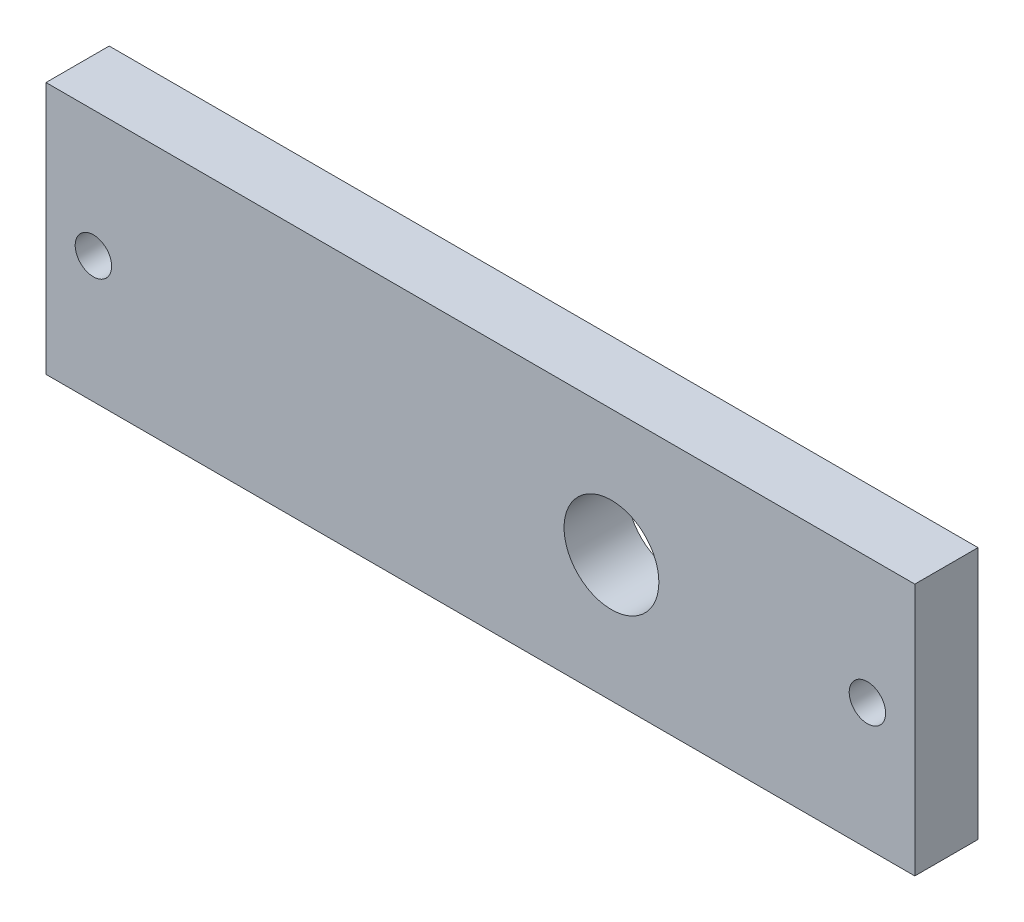
ISO-10303-21;
HEADER;
FILE_DESCRIPTION(('STEP AP214'),'2;1');
FILE_NAME('part.step','',(''),(''),'','','');
FILE_SCHEMA(('AUTOMOTIVE_DESIGN { 1 0 10303 214 1 1 1 1 }'));
ENDSEC;
DATA;
#1=APPLICATION_CONTEXT('core data for automotive mechanical design processes');
#2=APPLICATION_PROTOCOL_DEFINITION('international standard','automotive_design',2000,#1);
#3=PRODUCT_CONTEXT('',#1,'mechanical');
#4=PRODUCT('Part','Part','',(#3));
#5=PRODUCT_RELATED_PRODUCT_CATEGORY('part','',(#4));
#6=PRODUCT_DEFINITION_FORMATION('','',#4);
#7=PRODUCT_DEFINITION_CONTEXT('part definition',#1,'design');
#8=PRODUCT_DEFINITION('design','',#6,#7);
#9=PRODUCT_DEFINITION_SHAPE('','',#8);
#10=(LENGTH_UNIT() NAMED_UNIT(*) SI_UNIT(.MILLI.,.METRE.));
#11=(NAMED_UNIT(*) PLANE_ANGLE_UNIT() SI_UNIT($,.RADIAN.));
#12=(NAMED_UNIT(*) SI_UNIT($,.STERADIAN.) SOLID_ANGLE_UNIT());
#13=UNCERTAINTY_MEASURE_WITH_UNIT(LENGTH_MEASURE(1.E-05),#10,'distance_accuracy_value','');
#14=(GEOMETRIC_REPRESENTATION_CONTEXT(3) GLOBAL_UNCERTAINTY_ASSIGNED_CONTEXT((#13)) GLOBAL_UNIT_ASSIGNED_CONTEXT((#10,
#11,#12)) REPRESENTATION_CONTEXT('',''));
#15=CARTESIAN_POINT('',(0.,0.,0.));
#16=DIRECTION('',(0.,0.,1.));
#17=DIRECTION('',(1.,0.,0.));
#18=AXIS2_PLACEMENT_3D('',#15,#16,#17);
#19=CARTESIAN_POINT('',(0.,0.,3.175));
#20=DIRECTION('',(0.,0.,-1.));
#21=DIRECTION('',(-1.,0.,0.));
#22=AXIS2_PLACEMENT_3D('',#19,#20,#21);
#23=PLANE('',#22);
#24=CARTESIAN_POINT('',(-38.8875,12.7,3.175));
#25=DIRECTION('',(0.,0.,1.));
#26=DIRECTION('',(1.,0.,0.));
#27=AXIS2_PLACEMENT_3D('',#24,#25,#26);
#28=CIRCLE('',#27,1.8288);
#29=CARTESIAN_POINT('',(-37.0587,12.7,3.175));
#30=VERTEX_POINT('',#29);
#31=EDGE_CURVE('E126',#30,#30,#28,.T.);
#32=ORIENTED_EDGE('',*,*,#31,.F.);
#33=EDGE_LOOP('',(#32));
#34=FACE_BOUND('',#33,.T.);
#35=CARTESIAN_POINT('',(38.8875,12.7,3.175));
#36=DIRECTION('',(0.,0.,1.));
#37=DIRECTION('',(1.,0.,0.));
#38=AXIS2_PLACEMENT_3D('',#35,#36,#37);
#39=CIRCLE('',#38,1.8288);
#40=CARTESIAN_POINT('',(40.7163,12.7,3.175));
#41=VERTEX_POINT('',#40);
#42=EDGE_CURVE('E120',#41,#41,#39,.T.);
#43=ORIENTED_EDGE('',*,*,#42,.F.);
#44=EDGE_LOOP('',(#43));
#45=FACE_BOUND('',#44,.T.);
#46=DIRECTION('',(0.,-1.,0.));
#47=VECTOR('',#46,1.);
#48=CARTESIAN_POINT('',(-43.65,0.,3.175));
#49=LINE('',#48,#47);
#50=CARTESIAN_POINT('',(-43.65,25.4,3.175));
#51=VERTEX_POINT('',#50);
#52=CARTESIAN_POINT('',(-43.65,0.,3.175));
#53=VERTEX_POINT('',#52);
#54=EDGE_CURVE('E85',#51,#53,#49,.T.);
#55=ORIENTED_EDGE('',*,*,#54,.T.);
#56=DIRECTION('',(1.,0.,0.));
#57=VECTOR('',#56,1.);
#58=CARTESIAN_POINT('',(-43.65,0.,3.175));
#59=LINE('',#58,#57);
#60=CARTESIAN_POINT('',(43.65,0.,3.175));
#61=VERTEX_POINT('',#60);
#62=EDGE_CURVE('E80',#53,#61,#59,.T.);
#63=ORIENTED_EDGE('',*,*,#62,.T.);
#64=DIRECTION('',(0.,1.,0.));
#65=VECTOR('',#64,1.);
#66=CARTESIAN_POINT('',(43.65,0.,3.175));
#67=LINE('',#66,#65);
#68=CARTESIAN_POINT('',(43.65,25.4,3.175));
#69=VERTEX_POINT('',#68);
#70=EDGE_CURVE('E83',#61,#69,#67,.T.);
#71=ORIENTED_EDGE('',*,*,#70,.T.);
#72=DIRECTION('',(-1.,0.,0.));
#73=VECTOR('',#72,1.);
#74=CARTESIAN_POINT('',(-43.65,25.4,3.175));
#75=LINE('',#74,#73);
#76=EDGE_CURVE('E50',#69,#51,#75,.T.);
#77=ORIENTED_EDGE('',*,*,#76,.T.);
#78=EDGE_LOOP('',(#55,#63,#71,#77));
#79=FACE_BOUND('',#78,.T.);
#80=CARTESIAN_POINT('',(13.17,12.7,3.175));
#81=DIRECTION('',(0.,0.,1.));
#82=DIRECTION('',(1.,0.,0.));
#83=AXIS2_PLACEMENT_3D('',#80,#81,#82);
#84=CIRCLE('',#83,4.7625);
#85=CARTESIAN_POINT('',(17.9325,12.7,3.175));
#86=VERTEX_POINT('',#85);
#87=EDGE_CURVE('E100',#86,#86,#84,.T.);
#88=ORIENTED_EDGE('',*,*,#87,.F.);
#89=EDGE_LOOP('',(#88));
#90=FACE_BOUND('',#89,.T.);
#91=ADVANCED_FACE('F33',(#34,#45,#79,#90),#23,.F.);
#92=CARTESIAN_POINT('',(0.,0.,-3.175));
#93=DIRECTION('',(0.,0.,-1.));
#94=DIRECTION('',(-1.,0.,0.));
#95=AXIS2_PLACEMENT_3D('',#92,#93,#94);
#96=PLANE('',#95);
#97=CARTESIAN_POINT('',(-38.8875,12.7,-3.175));
#98=DIRECTION('',(0.,0.,1.));
#99=DIRECTION('',(1.,0.,0.));
#100=AXIS2_PLACEMENT_3D('',#97,#98,#99);
#101=CIRCLE('',#100,1.8288);
#102=CARTESIAN_POINT('',(-37.0587,12.7,-3.175));
#103=VERTEX_POINT('',#102);
#104=EDGE_CURVE('E123',#103,#103,#101,.T.);
#105=ORIENTED_EDGE('',*,*,#104,.T.);
#106=EDGE_LOOP('',(#105));
#107=FACE_BOUND('',#106,.T.);
#108=CARTESIAN_POINT('',(38.8875,12.7,-3.175));
#109=DIRECTION('',(0.,0.,1.));
#110=DIRECTION('',(1.,0.,0.));
#111=AXIS2_PLACEMENT_3D('',#108,#109,#110);
#112=CIRCLE('',#111,1.8288);
#113=CARTESIAN_POINT('',(40.7163,12.7,-3.175));
#114=VERTEX_POINT('',#113);
#115=EDGE_CURVE('E115',#114,#114,#112,.T.);
#116=ORIENTED_EDGE('',*,*,#115,.T.);
#117=EDGE_LOOP('',(#116));
#118=FACE_BOUND('',#117,.T.);
#119=DIRECTION('',(0.,-1.,0.));
#120=VECTOR('',#119,1.);
#121=CARTESIAN_POINT('',(-43.65,0.,-3.175));
#122=LINE('',#121,#120);
#123=CARTESIAN_POINT('',(-43.65,25.4,-3.175));
#124=VERTEX_POINT('',#123);
#125=CARTESIAN_POINT('',(-43.65,0.,-3.175));
#126=VERTEX_POINT('',#125);
#127=EDGE_CURVE('E97',#124,#126,#122,.T.);
#128=ORIENTED_EDGE('',*,*,#127,.F.);
#129=DIRECTION('',(-1.,0.,0.));
#130=VECTOR('',#129,1.);
#131=CARTESIAN_POINT('',(-43.65,25.4,-3.175));
#132=LINE('',#131,#130);
#133=CARTESIAN_POINT('',(43.65,25.4,-3.175));
#134=VERTEX_POINT('',#133);
#135=EDGE_CURVE('E73',#134,#124,#132,.T.);
#136=ORIENTED_EDGE('',*,*,#135,.F.);
#137=DIRECTION('',(0.,1.,0.));
#138=VECTOR('',#137,1.);
#139=CARTESIAN_POINT('',(43.65,0.,-3.175));
#140=LINE('',#139,#138);
#141=CARTESIAN_POINT('',(43.65,0.,-3.175));
#142=VERTEX_POINT('',#141);
#143=EDGE_CURVE('E67',#142,#134,#140,.T.);
#144=ORIENTED_EDGE('',*,*,#143,.F.);
#145=DIRECTION('',(1.,0.,0.));
#146=VECTOR('',#145,1.);
#147=CARTESIAN_POINT('',(-43.65,0.,-3.175));
#148=LINE('',#147,#146);
#149=EDGE_CURVE('E89',#126,#142,#148,.T.);
#150=ORIENTED_EDGE('',*,*,#149,.F.);
#151=EDGE_LOOP('',(#128,#136,#144,#150));
#152=FACE_BOUND('',#151,.T.);
#153=CARTESIAN_POINT('',(13.17,12.7,-3.175));
#154=DIRECTION('',(0.,0.,1.));
#155=DIRECTION('',(1.,0.,0.));
#156=AXIS2_PLACEMENT_3D('',#153,#154,#155);
#157=CIRCLE('',#156,4.7625);
#158=CARTESIAN_POINT('',(17.9325,12.7,-3.175));
#159=VERTEX_POINT('',#158);
#160=EDGE_CURVE('E112',#159,#159,#157,.T.);
#161=ORIENTED_EDGE('',*,*,#160,.T.);
#162=EDGE_LOOP('',(#161));
#163=FACE_BOUND('',#162,.T.);
#164=ADVANCED_FACE('F108',(#107,#118,#152,#163),#96,.T.);
#165=CARTESIAN_POINT('',(-43.65,0.,3.175));
#166=DIRECTION('',(1.,0.,0.));
#167=DIRECTION('',(0.,0.,-1.));
#168=AXIS2_PLACEMENT_3D('',#165,#166,#167);
#169=PLANE('',#168);
#170=ORIENTED_EDGE('',*,*,#127,.T.);
#171=DIRECTION('',(0.,0.,-1.));
#172=VECTOR('',#171,1.);
#173=CARTESIAN_POINT('',(-43.65,0.,3.175));
#174=LINE('',#173,#172);
#175=EDGE_CURVE('E11',#53,#126,#174,.T.);
#176=ORIENTED_EDGE('',*,*,#175,.F.);
#177=ORIENTED_EDGE('',*,*,#54,.F.);
#178=DIRECTION('',(0.,0.,-1.));
#179=VECTOR('',#178,1.);
#180=CARTESIAN_POINT('',(-43.65,25.4,3.175));
#181=LINE('',#180,#179);
#182=EDGE_CURVE('E93',#51,#124,#181,.T.);
#183=ORIENTED_EDGE('',*,*,#182,.T.);
#184=EDGE_LOOP('',(#170,#176,#177,#183));
#185=FACE_BOUND('',#184,.T.);
#186=ADVANCED_FACE('F35',(#185),#169,.F.);
#187=CARTESIAN_POINT('',(-43.65,0.,3.175));
#188=DIRECTION('',(0.,1.,0.));
#189=DIRECTION('',(0.,0.,1.));
#190=AXIS2_PLACEMENT_3D('',#187,#188,#189);
#191=PLANE('',#190);
#192=ORIENTED_EDGE('',*,*,#149,.T.);
#193=DIRECTION('',(0.,0.,-1.));
#194=VECTOR('',#193,1.);
#195=CARTESIAN_POINT('',(43.65,0.,3.175));
#196=LINE('',#195,#194);
#197=EDGE_CURVE('E42',#61,#142,#196,.T.);
#198=ORIENTED_EDGE('',*,*,#197,.F.);
#199=ORIENTED_EDGE('',*,*,#62,.F.);
#200=ORIENTED_EDGE('',*,*,#175,.T.);
#201=EDGE_LOOP('',(#192,#198,#199,#200));
#202=FACE_BOUND('',#201,.T.);
#203=ADVANCED_FACE('F88',(#202),#191,.F.);
#204=CARTESIAN_POINT('',(43.65,0.,3.175));
#205=DIRECTION('',(-1.,0.,0.));
#206=DIRECTION('',(0.,0.,1.));
#207=AXIS2_PLACEMENT_3D('',#204,#205,#206);
#208=PLANE('',#207);
#209=ORIENTED_EDGE('',*,*,#143,.T.);
#210=DIRECTION('',(0.,0.,-1.));
#211=VECTOR('',#210,1.);
#212=CARTESIAN_POINT('',(43.65,25.4,3.175));
#213=LINE('',#212,#211);
#214=EDGE_CURVE('E90',#69,#134,#213,.T.);
#215=ORIENTED_EDGE('',*,*,#214,.F.);
#216=ORIENTED_EDGE('',*,*,#70,.F.);
#217=ORIENTED_EDGE('',*,*,#197,.T.);
#218=EDGE_LOOP('',(#209,#215,#216,#217));
#219=FACE_BOUND('',#218,.T.);
#220=ADVANCED_FACE('F91',(#219),#208,.F.);
#221=CARTESIAN_POINT('',(-43.65,25.4,3.175));
#222=DIRECTION('',(0.,-1.,0.));
#223=DIRECTION('',(0.,0.,-1.));
#224=AXIS2_PLACEMENT_3D('',#221,#222,#223);
#225=PLANE('',#224);
#226=ORIENTED_EDGE('',*,*,#135,.T.);
#227=ORIENTED_EDGE('',*,*,#182,.F.);
#228=ORIENTED_EDGE('',*,*,#76,.F.);
#229=ORIENTED_EDGE('',*,*,#214,.T.);
#230=EDGE_LOOP('',(#226,#227,#228,#229));
#231=FACE_BOUND('',#230,.T.);
#232=ADVANCED_FACE('F105',(#231),#225,.F.);
#233=CARTESIAN_POINT('',(13.17,12.7,3.175));
#234=DIRECTION('',(0.,0.,-1.));
#235=DIRECTION('',(-1.,0.,0.));
#236=AXIS2_PLACEMENT_3D('',#233,#234,#235);
#237=CYLINDRICAL_SURFACE('',#236,4.7625);
#238=ORIENTED_EDGE('',*,*,#87,.T.);
#239=EDGE_LOOP('',(#238));
#240=FACE_BOUND('',#239,.T.);
#241=ORIENTED_EDGE('',*,*,#160,.F.);
#242=EDGE_LOOP('',(#241));
#243=FACE_BOUND('',#242,.T.);
#244=ADVANCED_FACE('F139',(#240,#243),#237,.F.);
#245=CARTESIAN_POINT('',(38.8875,12.7,3.175));
#246=DIRECTION('',(0.,0.,1.));
#247=DIRECTION('',(1.,0.,0.));
#248=AXIS2_PLACEMENT_3D('',#245,#246,#247);
#249=CYLINDRICAL_SURFACE('',#248,1.8288);
#250=ORIENTED_EDGE('',*,*,#115,.F.);
#251=EDGE_LOOP('',(#250));
#252=FACE_BOUND('',#251,.T.);
#253=ORIENTED_EDGE('',*,*,#42,.T.);
#254=EDGE_LOOP('',(#253));
#255=FACE_BOUND('',#254,.T.);
#256=ADVANCED_FACE('F137',(#252,#255),#249,.F.);
#257=CARTESIAN_POINT('',(-38.8875,12.7,3.175));
#258=DIRECTION('',(0.,0.,1.));
#259=DIRECTION('',(1.,0.,0.));
#260=AXIS2_PLACEMENT_3D('',#257,#258,#259);
#261=CYLINDRICAL_SURFACE('',#260,1.8288);
#262=ORIENTED_EDGE('',*,*,#104,.F.);
#263=EDGE_LOOP('',(#262));
#264=FACE_BOUND('',#263,.T.);
#265=ORIENTED_EDGE('',*,*,#31,.T.);
#266=EDGE_LOOP('',(#265));
#267=FACE_BOUND('',#266,.T.);
#268=ADVANCED_FACE('F130',(#264,#267),#261,.F.);
#269=CLOSED_SHELL('',(#91,#164,#186,#203,#220,#232,#244,#256,#268));
#270=MANIFOLD_SOLID_BREP('B2',#269);
#271=ADVANCED_BREP_SHAPE_REPRESENTATION('',(#18,#270),#14);
#272=SHAPE_DEFINITION_REPRESENTATION(#9,#271);
ENDSEC;
END-ISO-10303-21;
